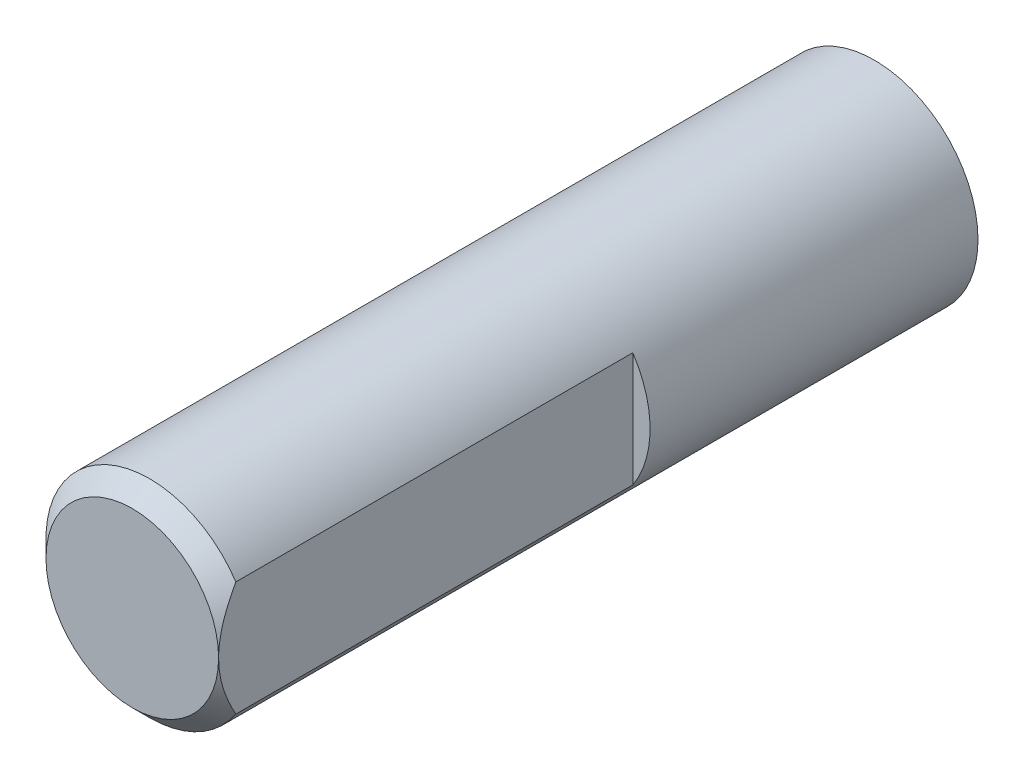
ISO-10303-21;
HEADER;
FILE_DESCRIPTION(('STEP AP214'),'2;1');
FILE_NAME('part.step','',(''),(''),'','','');
FILE_SCHEMA(('AUTOMOTIVE_DESIGN { 1 0 10303 214 1 1 1 1 }'));
ENDSEC;
DATA;
#1=APPLICATION_CONTEXT('core data for automotive mechanical design processes');
#2=APPLICATION_PROTOCOL_DEFINITION('international standard','automotive_design',2000,#1);
#3=PRODUCT_CONTEXT('',#1,'mechanical');
#4=PRODUCT('Part','Part','',(#3));
#5=PRODUCT_RELATED_PRODUCT_CATEGORY('part','',(#4));
#6=PRODUCT_DEFINITION_FORMATION('','',#4);
#7=PRODUCT_DEFINITION_CONTEXT('part definition',#1,'design');
#8=PRODUCT_DEFINITION('design','',#6,#7);
#9=PRODUCT_DEFINITION_SHAPE('','',#8);
#10=(LENGTH_UNIT() NAMED_UNIT(*) SI_UNIT(.MILLI.,.METRE.));
#11=(NAMED_UNIT(*) PLANE_ANGLE_UNIT() SI_UNIT($,.RADIAN.));
#12=(NAMED_UNIT(*) SI_UNIT($,.STERADIAN.) SOLID_ANGLE_UNIT());
#13=UNCERTAINTY_MEASURE_WITH_UNIT(LENGTH_MEASURE(1.E-05),#10,'distance_accuracy_value','');
#14=(GEOMETRIC_REPRESENTATION_CONTEXT(3) GLOBAL_UNCERTAINTY_ASSIGNED_CONTEXT((#13)) GLOBAL_UNIT_ASSIGNED_CONTEXT((#10,
#11,#12)) REPRESENTATION_CONTEXT('',''));
#15=CARTESIAN_POINT('',(0.,0.,0.));
#16=DIRECTION('',(0.,0.,1.));
#17=DIRECTION('',(1.,0.,0.));
#18=AXIS2_PLACEMENT_3D('',#15,#16,#17);
#19=CARTESIAN_POINT('',(0.,0.,21.5));
#20=DIRECTION('',(0.,0.,-1.));
#21=DIRECTION('',(-1.,0.,0.));
#22=AXIS2_PLACEMENT_3D('',#19,#20,#21);
#23=CYLINDRICAL_SURFACE('',#22,3.);
#24=DIRECTION('',(0.,0.,1.));
#25=VECTOR('',#24,1.);
#26=CARTESIAN_POINT('',(2.5,-1.6583123951777,9.5));
#27=LINE('',#26,#25);
#28=CARTESIAN_POINT('',(2.5,-1.6583123951777,9.5));
#29=VERTEX_POINT('',#28);
#30=CARTESIAN_POINT('',(2.5,-1.6583123951777,21.));
#31=VERTEX_POINT('',#30);
#32=EDGE_CURVE('E78',#29,#31,#27,.T.);
#33=ORIENTED_EDGE('',*,*,#32,.T.);
#34=CARTESIAN_POINT('',(0.,0.,21.));
#35=DIRECTION('',(0.,0.,1.));
#36=DIRECTION('',(1.,0.,0.));
#37=AXIS2_PLACEMENT_3D('',#34,#35,#36);
#38=CIRCLE('',#37,3.);
#39=CARTESIAN_POINT('',(2.5,1.6583123951777,21.));
#40=VERTEX_POINT('',#39);
#41=EDGE_CURVE('E11',#31,#40,#38,.F.);
#42=ORIENTED_EDGE('',*,*,#41,.T.);
#43=DIRECTION('',(0.,0.,1.));
#44=VECTOR('',#43,1.);
#45=CARTESIAN_POINT('',(2.5,1.6583123951777,9.5));
#46=LINE('',#45,#44);
#47=CARTESIAN_POINT('',(2.5,1.6583123951777,9.5));
#48=VERTEX_POINT('',#47);
#49=EDGE_CURVE('E76',#48,#40,#46,.T.);
#50=ORIENTED_EDGE('',*,*,#49,.F.);
#51=CARTESIAN_POINT('',(0.,0.,9.5));
#52=DIRECTION('',(0.,0.,1.));
#53=DIRECTION('',(1.,0.,0.));
#54=AXIS2_PLACEMENT_3D('',#51,#52,#53);
#55=CIRCLE('',#54,3.);
#56=EDGE_CURVE('E69',#29,#48,#55,.T.);
#57=ORIENTED_EDGE('',*,*,#56,.F.);
#58=EDGE_LOOP('',(#33,#42,#50,#57));
#59=FACE_BOUND('',#58,.T.);
#60=CARTESIAN_POINT('',(0.,0.,0.));
#61=DIRECTION('',(0.,0.,1.));
#62=DIRECTION('',(1.,0.,0.));
#63=AXIS2_PLACEMENT_3D('',#60,#61,#62);
#64=CIRCLE('',#63,3.);
#65=CARTESIAN_POINT('',(3.,0.,0.));
#66=VERTEX_POINT('',#65);
#67=EDGE_CURVE('E87',#66,#66,#64,.T.);
#68=ORIENTED_EDGE('',*,*,#67,.T.);
#69=EDGE_LOOP('',(#68));
#70=FACE_BOUND('',#69,.T.);
#71=ADVANCED_FACE('F37',(#59,#70),#23,.T.);
#72=CARTESIAN_POINT('',(0.,0.,21.5));
#73=DIRECTION('',(0.,0.,1.));
#74=DIRECTION('',(1.,0.,0.));
#75=AXIS2_PLACEMENT_3D('',#72,#73,#74);
#76=PLANE('',#75);
#77=CARTESIAN_POINT('',(0.,0.,21.5));
#78=DIRECTION('',(0.,0.,1.));
#79=DIRECTION('',(1.,0.,0.));
#80=AXIS2_PLACEMENT_3D('',#77,#78,#79);
#81=CIRCLE('',#80,2.5);
#82=CARTESIAN_POINT('',(2.5,0.,21.5));
#83=VERTEX_POINT('',#82);
#84=EDGE_CURVE('E93',#83,#83,#81,.T.);
#85=ORIENTED_EDGE('',*,*,#84,.T.);
#86=EDGE_LOOP('',(#85));
#87=FACE_BOUND('',#86,.T.);
#88=ADVANCED_FACE('F110',(#87),#76,.T.);
#89=CARTESIAN_POINT('',(0.,0.,0.));
#90=DIRECTION('',(0.,0.,1.));
#91=DIRECTION('',(1.,0.,0.));
#92=AXIS2_PLACEMENT_3D('',#89,#90,#91);
#93=PLANE('',#92);
#94=ORIENTED_EDGE('',*,*,#67,.F.);
#95=EDGE_LOOP('',(#94));
#96=FACE_BOUND('',#95,.T.);
#97=ADVANCED_FACE('F109',(#96),#93,.F.);
#98=CARTESIAN_POINT('',(2.5,1.6583123951777,9.5));
#99=DIRECTION('',(-1.,0.,0.));
#100=DIRECTION('',(0.,0.,1.));
#101=AXIS2_PLACEMENT_3D('',#98,#99,#100);
#102=PLANE('',#101);
#103=CARTESIAN_POINT('',(2.5,1.6583123951777,21.));
#104=CARTESIAN_POINT('',(2.5,1.61304419071273,21.0250200255843));
#105=CARTESIAN_POINT('',(2.5,1.56747781751027,21.049499427219));
#106=CARTESIAN_POINT('',(2.5,1.47571363154993,21.0972096867305));
#107=CARTESIAN_POINT('',(2.5,1.42951600534284,21.1204409038781));
#108=CARTESIAN_POINT('',(2.5,1.28946898250347,21.188233741468));
#109=CARTESIAN_POINT('',(2.5,1.19456817295725,21.2306685534991));
#110=CARTESIAN_POINT('',(2.5,1.00435832661106,21.3071641313579));
#111=CARTESIAN_POINT('',(2.5,0.909128166857117,21.3414185932365));
#112=CARTESIAN_POINT('',(2.5,0.715960996402805,21.4011186383457));
#113=CARTESIAN_POINT('',(2.5,0.618025975916641,21.4265705213043));
#114=CARTESIAN_POINT('',(2.5,0.434096531038006,21.46395141614));
#115=CARTESIAN_POINT('',(2.5,0.348395131920399,21.4772928993308));
#116=CARTESIAN_POINT('',(2.5,0.218706232970867,21.4908266543301));
#117=CARTESIAN_POINT('',(2.5,0.17504227488708,21.4942588205655));
#118=CARTESIAN_POINT('',(2.5,0.0875881850216984,21.4988484547413));
#119=CARTESIAN_POINT('',(2.5,0.0437980337548221,21.5000055502065));
#120=CARTESIAN_POINT('',(2.5,0.,21.5));
#121=B_SPLINE_CURVE_WITH_KNOTS('',3,(#103,#104,#105,#106,#107,#108,#109,#110,#111,#112,#113,
#114,#115,#116,#117,#118,#119,#120),.UNSPECIFIED.,.F.,.F.,(4,2,2,2,2,2,2,2,4),(0.,
0.155160114661541,0.310275326953931,0.621889187467566,0.925164565305232,1.22822244720193,
1.48798349653102,1.61932602447731,1.75069005406606),.UNSPECIFIED.);
#122=EDGE_CURVE('E96',#40,#83,#121,.T.);
#123=ORIENTED_EDGE('',*,*,#122,.T.);
#124=CARTESIAN_POINT('',(2.5,0.,21.5));
#125=CARTESIAN_POINT('',(2.5,-0.0768428391803911,21.5000643176381));
#126=CARTESIAN_POINT('',(2.5,-0.153646619440305,21.4964585669139));
#127=CARTESIAN_POINT('',(2.5,-0.306486913990631,21.4824138186156));
#128=CARTESIAN_POINT('',(2.5,-0.382524604614592,21.4719877566791));
#129=CARTESIAN_POINT('',(2.5,-0.532231201598341,21.4450231886171));
#130=CARTESIAN_POINT('',(2.5,-0.605918543015125,21.4285851348585));
#131=CARTESIAN_POINT('',(2.5,-0.751897163106768,21.3903277696489));
#132=CARTESIAN_POINT('',(2.5,-0.824187885624651,21.3685063602176));
#133=CARTESIAN_POINT('',(2.5,-0.961361204559369,21.3222417065684));
#134=CARTESIAN_POINT('',(2.5,-1.02636662586387,21.2981581621012));
#135=CARTESIAN_POINT('',(2.5,-1.15505562355539,21.2466971992364));
#136=CARTESIAN_POINT('',(2.5,-1.21873914323977,21.2193196398836));
#137=CARTESIAN_POINT('',(2.5,-1.34581351001767,21.1613450460911));
#138=CARTESIAN_POINT('',(2.5,-1.40918435962136,21.1307045192353));
#139=CARTESIAN_POINT('',(2.5,-1.53466113602633,21.067035036112));
#140=CARTESIAN_POINT('',(2.5,-1.59676793059763,21.0340077944289));
#141=CARTESIAN_POINT('',(2.5,-1.6583123951777,21.));
#142=B_SPLINE_CURVE_WITH_KNOTS('',3,(#124,#125,#126,#127,#128,#129,#130,#131,#132,#133,#134,
#135,#136,#137,#138,#139,#140,#141),.UNSPECIFIED.,.F.,.F.,(4,2,2,2,2,2,2,2,4),(0.,
0.230381722715165,0.460327757459297,0.686595219702824,0.912951001700758,1.120819357645,
1.32869661170077,1.53981070703045,1.75077462023261),.UNSPECIFIED.);
#143=EDGE_CURVE('E47',#83,#31,#142,.T.);
#144=ORIENTED_EDGE('',*,*,#143,.T.);
#145=ORIENTED_EDGE('',*,*,#32,.F.);
#146=DIRECTION('',(0.,-1.,0.));
#147=VECTOR('',#146,1.);
#148=CARTESIAN_POINT('',(2.5,1.6583123951777,9.5));
#149=LINE('',#148,#147);
#150=EDGE_CURVE('E72',#48,#29,#149,.T.);
#151=ORIENTED_EDGE('',*,*,#150,.F.);
#152=ORIENTED_EDGE('',*,*,#49,.T.);
#153=EDGE_LOOP('',(#123,#144,#145,#151,#152));
#154=FACE_BOUND('',#153,.T.);
#155=ADVANCED_FACE('F75',(#154),#102,.F.);
#156=CARTESIAN_POINT('',(0.,0.,9.5));
#157=DIRECTION('',(0.,0.,1.));
#158=DIRECTION('',(1.,0.,0.));
#159=AXIS2_PLACEMENT_3D('',#156,#157,#158);
#160=PLANE('',#159);
#161=ORIENTED_EDGE('',*,*,#56,.T.);
#162=ORIENTED_EDGE('',*,*,#150,.T.);
#163=EDGE_LOOP('',(#161,#162));
#164=FACE_BOUND('',#163,.T.);
#165=ADVANCED_FACE('F71',(#164),#160,.T.);
#166=CARTESIAN_POINT('',(0.,0.,21.5));
#167=DIRECTION('',(0.,0.,-1.));
#168=DIRECTION('',(-1.,0.,0.));
#169=AXIS2_PLACEMENT_3D('',#166,#167,#168);
#170=CONICAL_SURFACE('',#169,2.5,0.78539816339745);
#171=ORIENTED_EDGE('',*,*,#122,.F.);
#172=ORIENTED_EDGE('',*,*,#41,.F.);
#173=ORIENTED_EDGE('',*,*,#143,.F.);
#174=ORIENTED_EDGE('',*,*,#84,.F.);
#175=EDGE_LOOP('',(#171,#172,#173,#174));
#176=FACE_BOUND('',#175,.T.);
#177=ADVANCED_FACE('F39',(#176),#170,.T.);
#178=CLOSED_SHELL('',(#71,#88,#97,#155,#165,#177));
#179=MANIFOLD_SOLID_BREP('B2',#178);
#180=ADVANCED_BREP_SHAPE_REPRESENTATION('',(#18,#179),#14);
#181=SHAPE_DEFINITION_REPRESENTATION(#9,#180);
ENDSEC;
END-ISO-10303-21;
